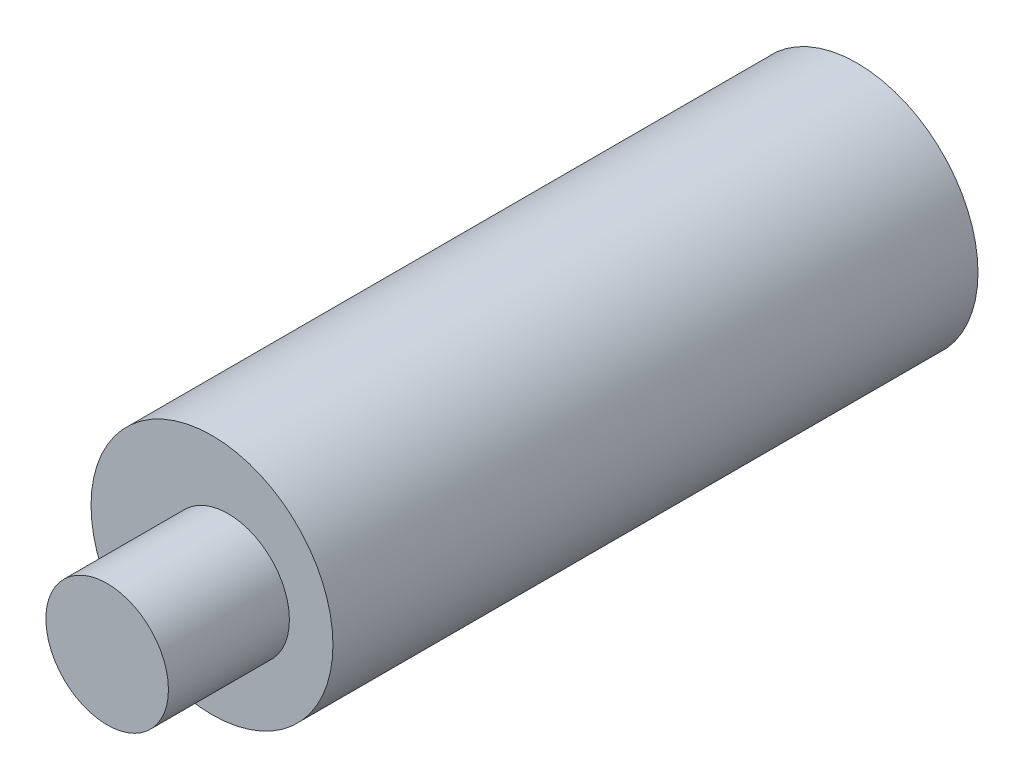
ISO-10303-21;
HEADER;
FILE_DESCRIPTION(('STEP AP214'),'2;1');
FILE_NAME('part.step','',(''),(''),'','','');
FILE_SCHEMA(('AUTOMOTIVE_DESIGN { 1 0 10303 214 1 1 1 1 }'));
ENDSEC;
DATA;
#1=APPLICATION_CONTEXT('core data for automotive mechanical design processes');
#2=APPLICATION_PROTOCOL_DEFINITION('international standard','automotive_design',2000,#1);
#3=PRODUCT_CONTEXT('',#1,'mechanical');
#4=PRODUCT('Part','Part','',(#3));
#5=PRODUCT_RELATED_PRODUCT_CATEGORY('part','',(#4));
#6=PRODUCT_DEFINITION_FORMATION('','',#4);
#7=PRODUCT_DEFINITION_CONTEXT('part definition',#1,'design');
#8=PRODUCT_DEFINITION('design','',#6,#7);
#9=PRODUCT_DEFINITION_SHAPE('','',#8);
#10=(LENGTH_UNIT() NAMED_UNIT(*) SI_UNIT(.MILLI.,.METRE.));
#11=(NAMED_UNIT(*) PLANE_ANGLE_UNIT() SI_UNIT($,.RADIAN.));
#12=(NAMED_UNIT(*) SI_UNIT($,.STERADIAN.) SOLID_ANGLE_UNIT());
#13=UNCERTAINTY_MEASURE_WITH_UNIT(LENGTH_MEASURE(1.E-05),#10,'distance_accuracy_value','');
#14=(GEOMETRIC_REPRESENTATION_CONTEXT(3) GLOBAL_UNCERTAINTY_ASSIGNED_CONTEXT((#13)) GLOBAL_UNIT_ASSIGNED_CONTEXT((#10,
#11,#12)) REPRESENTATION_CONTEXT('',''));
#15=CARTESIAN_POINT('',(0.,0.,0.));
#16=DIRECTION('',(0.,0.,1.));
#17=DIRECTION('',(1.,0.,0.));
#18=AXIS2_PLACEMENT_3D('',#15,#16,#17);
#19=CARTESIAN_POINT('',(0.,0.,25.4));
#20=DIRECTION('',(0.,0.,-1.));
#21=DIRECTION('',(-1.,0.,0.));
#22=AXIS2_PLACEMENT_3D('',#19,#20,#21);
#23=CYLINDRICAL_SURFACE('',#22,4.7625);
#24=CARTESIAN_POINT('',(0.,0.,25.4));
#25=DIRECTION('',(0.,0.,1.));
#26=DIRECTION('',(1.,0.,0.));
#27=AXIS2_PLACEMENT_3D('',#24,#25,#26);
#28=CIRCLE('',#27,4.7625);
#29=CARTESIAN_POINT('',(4.7625,0.,25.4));
#30=VERTEX_POINT('',#29);
#31=EDGE_CURVE('E11',#30,#30,#28,.T.);
#32=ORIENTED_EDGE('',*,*,#31,.F.);
#33=EDGE_LOOP('',(#32));
#34=FACE_BOUND('',#33,.T.);
#35=CARTESIAN_POINT('',(0.,0.,0.));
#36=DIRECTION('',(0.,0.,1.));
#37=DIRECTION('',(1.,0.,0.));
#38=AXIS2_PLACEMENT_3D('',#35,#36,#37);
#39=CIRCLE('',#38,4.7625);
#40=CARTESIAN_POINT('',(4.7625,0.,0.));
#41=VERTEX_POINT('',#40);
#42=EDGE_CURVE('E42',#41,#41,#39,.T.);
#43=ORIENTED_EDGE('',*,*,#42,.T.);
#44=EDGE_LOOP('',(#43));
#45=FACE_BOUND('',#44,.T.);
#46=ADVANCED_FACE('F39',(#34,#45),#23,.T.);
#47=CARTESIAN_POINT('',(0.,0.,25.4));
#48=DIRECTION('',(0.,0.,1.));
#49=DIRECTION('',(1.,0.,0.));
#50=AXIS2_PLACEMENT_3D('',#47,#48,#49);
#51=PLANE('',#50);
#52=CARTESIAN_POINT('',(0.635,0.,25.4));
#53=DIRECTION('',(0.,0.,1.));
#54=DIRECTION('',(1.,0.,0.));
#55=AXIS2_PLACEMENT_3D('',#52,#53,#54);
#56=CIRCLE('',#55,2.413);
#57=CARTESIAN_POINT('',(3.048,0.,25.4));
#58=VERTEX_POINT('',#57);
#59=EDGE_CURVE('E55',#58,#58,#56,.T.);
#60=ORIENTED_EDGE('',*,*,#59,.F.);
#61=EDGE_LOOP('',(#60));
#62=FACE_BOUND('',#61,.T.);
#63=ORIENTED_EDGE('',*,*,#31,.T.);
#64=EDGE_LOOP('',(#63));
#65=FACE_BOUND('',#64,.T.);
#66=ADVANCED_FACE('F77',(#62,#65),#51,.T.);
#67=CARTESIAN_POINT('',(0.,0.,0.));
#68=DIRECTION('',(0.,0.,1.));
#69=DIRECTION('',(1.,0.,0.));
#70=AXIS2_PLACEMENT_3D('',#67,#68,#69);
#71=PLANE('',#70);
#72=CARTESIAN_POINT('',(0.,0.,0.));
#73=DIRECTION('',(0.,0.,-1.));
#74=DIRECTION('',(-1.,0.,0.));
#75=AXIS2_PLACEMENT_3D('',#72,#73,#74);
#76=CIRCLE('',#75,2.5527);
#77=CARTESIAN_POINT('',(-2.5527,0.,0.));
#78=VERTEX_POINT('',#77);
#79=EDGE_CURVE('E64',#78,#78,#76,.T.);
#80=ORIENTED_EDGE('',*,*,#79,.F.);
#81=EDGE_LOOP('',(#80));
#82=FACE_BOUND('',#81,.T.);
#83=ORIENTED_EDGE('',*,*,#42,.F.);
#84=EDGE_LOOP('',(#83));
#85=FACE_BOUND('',#84,.T.);
#86=ADVANCED_FACE('F79',(#82,#85),#71,.F.);
#87=CARTESIAN_POINT('',(0.635,0.,30.1625));
#88=DIRECTION('',(0.,0.,-1.));
#89=DIRECTION('',(-1.,0.,0.));
#90=AXIS2_PLACEMENT_3D('',#87,#88,#89);
#91=CYLINDRICAL_SURFACE('',#90,2.413);
#92=CARTESIAN_POINT('',(0.635,0.,30.1625));
#93=DIRECTION('',(0.,0.,1.));
#94=DIRECTION('',(1.,0.,0.));
#95=AXIS2_PLACEMENT_3D('',#92,#93,#94);
#96=CIRCLE('',#95,2.413);
#97=CARTESIAN_POINT('',(3.048,0.,30.1625));
#98=VERTEX_POINT('',#97);
#99=EDGE_CURVE('E52',#98,#98,#96,.T.);
#100=ORIENTED_EDGE('',*,*,#99,.F.);
#101=EDGE_LOOP('',(#100));
#102=FACE_BOUND('',#101,.T.);
#103=ORIENTED_EDGE('',*,*,#59,.T.);
#104=EDGE_LOOP('',(#103));
#105=FACE_BOUND('',#104,.T.);
#106=ADVANCED_FACE('F75',(#102,#105),#91,.T.);
#107=CARTESIAN_POINT('',(0.635,0.,30.1625));
#108=DIRECTION('',(0.,0.,1.));
#109=DIRECTION('',(1.,0.,0.));
#110=AXIS2_PLACEMENT_3D('',#107,#108,#109);
#111=PLANE('',#110);
#112=ORIENTED_EDGE('',*,*,#99,.T.);
#113=EDGE_LOOP('',(#112));
#114=FACE_BOUND('',#113,.T.);
#115=ADVANCED_FACE('F90',(#114),#111,.T.);
#116=CARTESIAN_POINT('',(0.,0.,19.05));
#117=DIRECTION('',(0.,0.,-1.));
#118=DIRECTION('',(-1.,0.,0.));
#119=AXIS2_PLACEMENT_3D('',#116,#117,#118);
#120=CYLINDRICAL_SURFACE('',#119,2.5527);
#121=CARTESIAN_POINT('',(0.,0.,19.05));
#122=DIRECTION('',(0.,0.,-1.));
#123=DIRECTION('',(-1.,0.,0.));
#124=AXIS2_PLACEMENT_3D('',#121,#122,#123);
#125=CIRCLE('',#124,2.5527);
#126=CARTESIAN_POINT('',(-2.5527,0.,19.05));
#127=VERTEX_POINT('',#126);
#128=EDGE_CURVE('E68',#127,#127,#125,.T.);
#129=ORIENTED_EDGE('',*,*,#128,.F.);
#130=EDGE_LOOP('',(#129));
#131=FACE_BOUND('',#130,.T.);
#132=ORIENTED_EDGE('',*,*,#79,.T.);
#133=EDGE_LOOP('',(#132));
#134=FACE_BOUND('',#133,.T.);
#135=ADVANCED_FACE('F94',(#131,#134),#120,.F.);
#136=CARTESIAN_POINT('',(0.,0.,19.05));
#137=DIRECTION('',(0.,0.,-1.));
#138=DIRECTION('',(-1.,0.,0.));
#139=AXIS2_PLACEMENT_3D('',#136,#137,#138);
#140=PLANE('',#139);
#141=ORIENTED_EDGE('',*,*,#128,.T.);
#142=EDGE_LOOP('',(#141));
#143=FACE_BOUND('',#142,.T.);
#144=ADVANCED_FACE('F98',(#143),#140,.T.);
#145=CLOSED_SHELL('',(#46,#66,#86,#106,#115,#135,#144));
#146=MANIFOLD_SOLID_BREP('B2',#145);
#147=ADVANCED_BREP_SHAPE_REPRESENTATION('',(#18,#146),#14);
#148=SHAPE_DEFINITION_REPRESENTATION(#9,#147);
ENDSEC;
END-ISO-10303-21;
